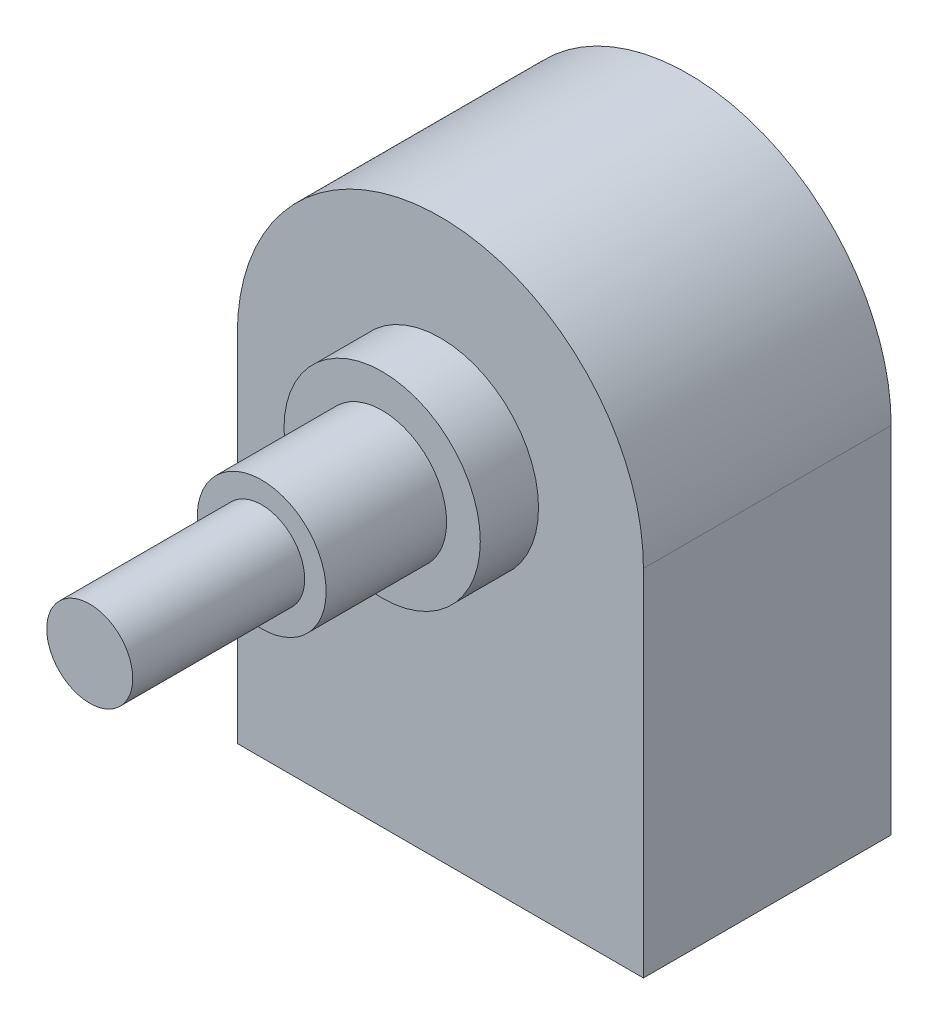
ISO-10303-21;
HEADER;
FILE_DESCRIPTION(('STEP AP214'),'2;1');
FILE_NAME('part.step','',(''),(''),'','','');
FILE_SCHEMA(('AUTOMOTIVE_DESIGN { 1 0 10303 214 1 1 1 1 }'));
ENDSEC;
DATA;
#1=APPLICATION_CONTEXT('core data for automotive mechanical design processes');
#2=APPLICATION_PROTOCOL_DEFINITION('international standard','automotive_design',2000,#1);
#3=PRODUCT_CONTEXT('',#1,'mechanical');
#4=PRODUCT('Part','Part','',(#3));
#5=PRODUCT_RELATED_PRODUCT_CATEGORY('part','',(#4));
#6=PRODUCT_DEFINITION_FORMATION('','',#4);
#7=PRODUCT_DEFINITION_CONTEXT('part definition',#1,'design');
#8=PRODUCT_DEFINITION('design','',#6,#7);
#9=PRODUCT_DEFINITION_SHAPE('','',#8);
#10=(LENGTH_UNIT() NAMED_UNIT(*) SI_UNIT(.MILLI.,.METRE.));
#11=(NAMED_UNIT(*) PLANE_ANGLE_UNIT() SI_UNIT($,.RADIAN.));
#12=(NAMED_UNIT(*) SI_UNIT($,.STERADIAN.) SOLID_ANGLE_UNIT());
#13=UNCERTAINTY_MEASURE_WITH_UNIT(LENGTH_MEASURE(1.E-05),#10,'distance_accuracy_value','');
#14=(GEOMETRIC_REPRESENTATION_CONTEXT(3) GLOBAL_UNCERTAINTY_ASSIGNED_CONTEXT((#13)) GLOBAL_UNIT_ASSIGNED_CONTEXT((#10,
#11,#12)) REPRESENTATION_CONTEXT('',''));
#15=CARTESIAN_POINT('',(0.,0.,0.));
#16=DIRECTION('',(0.,0.,1.));
#17=DIRECTION('',(1.,0.,0.));
#18=AXIS2_PLACEMENT_3D('',#15,#16,#17);
#19=CARTESIAN_POINT('',(-7.18,-7.1,15.3));
#20=DIRECTION('',(0.,-1.,0.));
#21=DIRECTION('',(0.,0.,-1.));
#22=AXIS2_PLACEMENT_3D('',#19,#20,#21);
#23=PLANE('',#22);
#24=DIRECTION('',(1.,0.,0.));
#25=VECTOR('',#24,1.);
#26=CARTESIAN_POINT('',(2.18,-7.1,12.1370865970543));
#27=LINE('',#26,#25);
#28=CARTESIAN_POINT('',(2.18,-7.1,12.1370865970543));
#29=VERTEX_POINT('',#28);
#30=CARTESIAN_POINT('',(2.82,-7.1,12.1370865970543));
#31=VERTEX_POINT('',#30);
#32=EDGE_CURVE('E247',#29,#31,#27,.T.);
#33=ORIENTED_EDGE('',*,*,#32,.F.);
#34=DIRECTION('',(0.,0.,-1.));
#35=VECTOR('',#34,1.);
#36=CARTESIAN_POINT('',(2.18,-7.1,12.1370865970543));
#37=LINE('',#36,#35);
#38=CARTESIAN_POINT('',(2.18,-7.1,12.7770865970543));
#39=VERTEX_POINT('',#38);
#40=EDGE_CURVE('E244',#39,#29,#37,.T.);
#41=ORIENTED_EDGE('',*,*,#40,.F.);
#42=DIRECTION('',(-1.,0.,0.));
#43=VECTOR('',#42,1.);
#44=CARTESIAN_POINT('',(2.18,-7.1,12.7770865970543));
#45=LINE('',#44,#43);
#46=CARTESIAN_POINT('',(2.82,-7.1,12.7770865970543));
#47=VERTEX_POINT('',#46);
#48=EDGE_CURVE('E256',#47,#39,#45,.T.);
#49=ORIENTED_EDGE('',*,*,#48,.F.);
#50=DIRECTION('',(0.,0.,1.));
#51=VECTOR('',#50,1.);
#52=CARTESIAN_POINT('',(2.82,-7.1,12.1370865970543));
#53=LINE('',#52,#51);
#54=EDGE_CURVE('E264',#31,#47,#53,.T.);
#55=ORIENTED_EDGE('',*,*,#54,.F.);
#56=EDGE_LOOP('',(#33,#41,#49,#55));
#57=FACE_BOUND('',#56,.T.);
#58=DIRECTION('',(1.,0.,0.));
#59=VECTOR('',#58,1.);
#60=CARTESIAN_POINT('',(-2.82,-7.1,12.1370865970543));
#61=LINE('',#60,#59);
#62=CARTESIAN_POINT('',(-2.82,-7.1,12.1370865970543));
#63=VERTEX_POINT('',#62);
#64=CARTESIAN_POINT('',(-2.18,-7.1,12.1370865970543));
#65=VERTEX_POINT('',#64);
#66=EDGE_CURVE('E318',#63,#65,#61,.T.);
#67=ORIENTED_EDGE('',*,*,#66,.F.);
#68=DIRECTION('',(0.,0.,-1.));
#69=VECTOR('',#68,1.);
#70=CARTESIAN_POINT('',(-2.82,-7.1,12.1370865970543));
#71=LINE('',#70,#69);
#72=CARTESIAN_POINT('',(-2.82,-7.1,12.7770865970543));
#73=VERTEX_POINT('',#72);
#74=EDGE_CURVE('E304',#73,#63,#71,.T.);
#75=ORIENTED_EDGE('',*,*,#74,.F.);
#76=DIRECTION('',(-1.,0.,0.));
#77=VECTOR('',#76,1.);
#78=CARTESIAN_POINT('',(-2.82,-7.1,12.7770865970543));
#79=LINE('',#78,#77);
#80=CARTESIAN_POINT('',(-2.18,-7.1,12.7770865970543));
#81=VERTEX_POINT('',#80);
#82=EDGE_CURVE('E309',#81,#73,#79,.T.);
#83=ORIENTED_EDGE('',*,*,#82,.F.);
#84=DIRECTION('',(0.,0.,1.));
#85=VECTOR('',#84,1.);
#86=CARTESIAN_POINT('',(-2.18,-7.1,12.1370865970543));
#87=LINE('',#86,#85);
#88=EDGE_CURVE('E320',#65,#81,#87,.T.);
#89=ORIENTED_EDGE('',*,*,#88,.F.);
#90=EDGE_LOOP('',(#67,#75,#83,#89));
#91=FACE_BOUND('',#90,.T.);
#92=DIRECTION('',(0.,0.,-1.));
#93=VECTOR('',#92,1.);
#94=CARTESIAN_POINT('',(-7.18,-7.1,8.2));
#95=LINE('',#94,#93);
#96=CARTESIAN_POINT('',(-7.18,-7.1,15.3));
#97=VERTEX_POINT('',#96);
#98=CARTESIAN_POINT('',(-7.18,-7.1,8.2));
#99=VERTEX_POINT('',#98);
#100=EDGE_CURVE('E363',#97,#99,#95,.T.);
#101=ORIENTED_EDGE('',*,*,#100,.T.);
#102=DIRECTION('',(1.,0.,0.));
#103=VECTOR('',#102,1.);
#104=CARTESIAN_POINT('',(7.18,-7.1,8.2));
#105=LINE('',#104,#103);
#106=CARTESIAN_POINT('',(7.18,-7.1,8.2));
#107=VERTEX_POINT('',#106);
#108=EDGE_CURVE('E366',#99,#107,#105,.T.);
#109=ORIENTED_EDGE('',*,*,#108,.T.);
#110=DIRECTION('',(0.,0.,1.));
#111=VECTOR('',#110,1.);
#112=CARTESIAN_POINT('',(7.18,-7.1,8.2));
#113=LINE('',#112,#111);
#114=CARTESIAN_POINT('',(7.18,-7.1,15.3));
#115=VERTEX_POINT('',#114);
#116=EDGE_CURVE('E370',#107,#115,#113,.T.);
#117=ORIENTED_EDGE('',*,*,#116,.T.);
#118=DIRECTION('',(-1.,0.,0.));
#119=VECTOR('',#118,1.);
#120=CARTESIAN_POINT('',(7.18,-7.1,15.3));
#121=LINE('',#120,#119);
#122=EDGE_CURVE('E373',#115,#97,#121,.T.);
#123=ORIENTED_EDGE('',*,*,#122,.T.);
#124=EDGE_LOOP('',(#101,#109,#117,#123));
#125=FACE_BOUND('',#124,.T.);
#126=DIRECTION('',(1.,0.,0.));
#127=VECTOR('',#126,1.);
#128=CARTESIAN_POINT('',(-5.32,-7.1,12.1370865970543));
#129=LINE('',#128,#127);
#130=CARTESIAN_POINT('',(-5.32,-7.1,12.1370865970543));
#131=VERTEX_POINT('',#130);
#132=CARTESIAN_POINT('',(-4.68,-7.1,12.1370865970543));
#133=VERTEX_POINT('',#132);
#134=EDGE_CURVE('E347',#131,#133,#129,.T.);
#135=ORIENTED_EDGE('',*,*,#134,.F.);
#136=DIRECTION('',(0.,0.,-1.));
#137=VECTOR('',#136,1.);
#138=CARTESIAN_POINT('',(-5.32,-7.1,12.1370865970543));
#139=LINE('',#138,#137);
#140=CARTESIAN_POINT('',(-5.32,-7.1,12.7770865970543));
#141=VERTEX_POINT('',#140);
#142=EDGE_CURVE('E333',#141,#131,#139,.T.);
#143=ORIENTED_EDGE('',*,*,#142,.F.);
#144=DIRECTION('',(-1.,0.,0.));
#145=VECTOR('',#144,1.);
#146=CARTESIAN_POINT('',(-5.32,-7.1,12.7770865970543));
#147=LINE('',#146,#145);
#148=CARTESIAN_POINT('',(-4.68,-7.1,12.7770865970543));
#149=VERTEX_POINT('',#148);
#150=EDGE_CURVE('E338',#149,#141,#147,.T.);
#151=ORIENTED_EDGE('',*,*,#150,.F.);
#152=DIRECTION('',(0.,0.,1.));
#153=VECTOR('',#152,1.);
#154=CARTESIAN_POINT('',(-4.68,-7.1,12.1370865970543));
#155=LINE('',#154,#153);
#156=EDGE_CURVE('E349',#133,#149,#155,.T.);
#157=ORIENTED_EDGE('',*,*,#156,.F.);
#158=EDGE_LOOP('',(#135,#143,#151,#157));
#159=FACE_BOUND('',#158,.T.);
#160=DIRECTION('',(1.,0.,0.));
#161=VECTOR('',#160,1.);
#162=CARTESIAN_POINT('',(-0.320000000000002,-7.1,12.1370865970543));
#163=LINE('',#162,#161);
#164=CARTESIAN_POINT('',(-0.320000000000002,-7.1,12.1370865970543));
#165=VERTEX_POINT('',#164);
#166=CARTESIAN_POINT('',(0.319999999999998,-7.1,12.1370865970543));
#167=VERTEX_POINT('',#166);
#168=EDGE_CURVE('E289',#165,#167,#163,.T.);
#169=ORIENTED_EDGE('',*,*,#168,.F.);
#170=DIRECTION('',(0.,0.,-1.));
#171=VECTOR('',#170,1.);
#172=CARTESIAN_POINT('',(-0.320000000000002,-7.1,12.1370865970543));
#173=LINE('',#172,#171);
#174=CARTESIAN_POINT('',(-0.320000000000002,-7.1,12.7770865970543));
#175=VERTEX_POINT('',#174);
#176=EDGE_CURVE('E275',#175,#165,#173,.T.);
#177=ORIENTED_EDGE('',*,*,#176,.F.);
#178=DIRECTION('',(-1.,0.,0.));
#179=VECTOR('',#178,1.);
#180=CARTESIAN_POINT('',(-0.320000000000002,-7.1,12.7770865970543));
#181=LINE('',#180,#179);
#182=CARTESIAN_POINT('',(0.319999999999998,-7.1,12.7770865970543));
#183=VERTEX_POINT('',#182);
#184=EDGE_CURVE('E280',#183,#175,#181,.T.);
#185=ORIENTED_EDGE('',*,*,#184,.F.);
#186=DIRECTION('',(0.,0.,1.));
#187=VECTOR('',#186,1.);
#188=CARTESIAN_POINT('',(0.319999999999998,-7.1,12.1370865970543));
#189=LINE('',#188,#187);
#190=EDGE_CURVE('E291',#167,#183,#189,.T.);
#191=ORIENTED_EDGE('',*,*,#190,.F.);
#192=EDGE_LOOP('',(#169,#177,#185,#191));
#193=FACE_BOUND('',#192,.T.);
#194=DIRECTION('',(1.,0.,0.));
#195=VECTOR('',#194,1.);
#196=CARTESIAN_POINT('',(4.68,-7.1,12.1370865970543));
#197=LINE('',#196,#195);
#198=CARTESIAN_POINT('',(4.68,-7.1,12.1370865970543));
#199=VERTEX_POINT('',#198);
#200=CARTESIAN_POINT('',(5.32,-7.1,12.1370865970543));
#201=VERTEX_POINT('',#200);
#202=EDGE_CURVE('E887',#199,#201,#197,.T.);
#203=ORIENTED_EDGE('',*,*,#202,.F.);
#204=DIRECTION('',(0.,0.,-1.));
#205=VECTOR('',#204,1.);
#206=CARTESIAN_POINT('',(4.68,-7.1,12.1370865970543));
#207=LINE('',#206,#205);
#208=CARTESIAN_POINT('',(4.68,-7.1,12.7770865970543));
#209=VERTEX_POINT('',#208);
#210=EDGE_CURVE('E242',#209,#199,#207,.T.);
#211=ORIENTED_EDGE('',*,*,#210,.F.);
#212=DIRECTION('',(-1.,0.,0.));
#213=VECTOR('',#212,1.);
#214=CARTESIAN_POINT('',(4.68,-7.1,12.7770865970543));
#215=LINE('',#214,#213);
#216=CARTESIAN_POINT('',(5.32,-7.1,12.7770865970543));
#217=VERTEX_POINT('',#216);
#218=EDGE_CURVE('E238',#217,#209,#215,.T.);
#219=ORIENTED_EDGE('',*,*,#218,.F.);
#220=DIRECTION('',(0.,0.,1.));
#221=VECTOR('',#220,1.);
#222=CARTESIAN_POINT('',(5.32,-7.1,12.1370865970543));
#223=LINE('',#222,#221);
#224=EDGE_CURVE('E884',#201,#217,#223,.T.);
#225=ORIENTED_EDGE('',*,*,#224,.F.);
#226=EDGE_LOOP('',(#203,#211,#219,#225));
#227=FACE_BOUND('',#226,.T.);
#228=ADVANCED_FACE('F33',(#57,#91,#125,#159,#193,#227),#23,.T.);
#229=CARTESIAN_POINT('',(0.,13.1,31.5));
#230=DIRECTION('',(0.,0.,1.));
#231=DIRECTION('',(1.,0.,0.));
#232=AXIS2_PLACEMENT_3D('',#229,#230,#231);
#233=PLANE('',#232);
#234=CARTESIAN_POINT('',(0.,13.1,31.5));
#235=DIRECTION('',(0.,0.,1.));
#236=DIRECTION('',(1.,0.,0.));
#237=AXIS2_PLACEMENT_3D('',#234,#235,#236);
#238=CIRCLE('',#237,4.7625);
#239=CARTESIAN_POINT('',(4.76250000000001,13.1,31.5));
#240=VERTEX_POINT('',#239);
#241=EDGE_CURVE('E401',#240,#240,#238,.T.);
#242=ORIENTED_EDGE('',*,*,#241,.T.);
#243=EDGE_LOOP('',(#242));
#244=FACE_BOUND('',#243,.T.);
#245=CARTESIAN_POINT('',(0.,13.1,31.5));
#246=DIRECTION('',(0.,0.,1.));
#247=DIRECTION('',(1.,0.,0.));
#248=AXIS2_PLACEMENT_3D('',#245,#246,#247);
#249=CIRCLE('',#248,3.175);
#250=CARTESIAN_POINT('',(3.17500000000001,13.1,31.5));
#251=VERTEX_POINT('',#250);
#252=EDGE_CURVE('E388',#251,#251,#249,.T.);
#253=ORIENTED_EDGE('',*,*,#252,.F.);
#254=EDGE_LOOP('',(#253));
#255=FACE_BOUND('',#254,.T.);
#256=ADVANCED_FACE('F479',(#244,#255),#233,.T.);
#257=CARTESIAN_POINT('',(0.,13.1,22.6));
#258=DIRECTION('',(0.,0.,1.));
#259=DIRECTION('',(1.,0.,0.));
#260=AXIS2_PLACEMENT_3D('',#257,#258,#259);
#261=PLANE('',#260);
#262=CARTESIAN_POINT('',(0.,13.1,22.6));
#263=DIRECTION('',(0.,0.,1.));
#264=DIRECTION('',(1.,0.,0.));
#265=AXIS2_PLACEMENT_3D('',#262,#263,#264);
#266=CIRCLE('',#265,7.25);
#267=CARTESIAN_POINT('',(7.25000000000001,13.1,22.6));
#268=VERTEX_POINT('',#267);
#269=EDGE_CURVE('E404',#268,#268,#266,.T.);
#270=ORIENTED_EDGE('',*,*,#269,.T.);
#271=EDGE_LOOP('',(#270));
#272=FACE_BOUND('',#271,.T.);
#273=CARTESIAN_POINT('',(0.,13.1,22.6));
#274=DIRECTION('',(0.,0.,1.));
#275=DIRECTION('',(1.,0.,0.));
#276=AXIS2_PLACEMENT_3D('',#273,#274,#275);
#277=CIRCLE('',#276,4.7625);
#278=CARTESIAN_POINT('',(4.76250000000001,13.1,22.6));
#279=VERTEX_POINT('',#278);
#280=EDGE_CURVE('E398',#279,#279,#277,.T.);
#281=ORIENTED_EDGE('',*,*,#280,.F.);
#282=EDGE_LOOP('',(#281));
#283=FACE_BOUND('',#282,.T.);
#284=ADVANCED_FACE('F459',(#272,#283),#261,.T.);
#285=CARTESIAN_POINT('',(0.,13.1,18.3));
#286=DIRECTION('',(0.,0.,-1.));
#287=DIRECTION('',(-1.,0.,0.));
#288=AXIS2_PLACEMENT_3D('',#285,#286,#287);
#289=PLANE('',#288);
#290=CARTESIAN_POINT('',(0.,13.1,18.3));
#291=DIRECTION('',(0.,0.,1.));
#292=DIRECTION('',(-1.,0.,0.));
#293=AXIS2_PLACEMENT_3D('',#290,#291,#292);
#294=CIRCLE('',#293,15.);
#295=CARTESIAN_POINT('',(15.,13.1,18.3));
#296=VERTEX_POINT('',#295);
#297=CARTESIAN_POINT('',(-15.,13.1,18.3));
#298=VERTEX_POINT('',#297);
#299=EDGE_CURVE('E410',#296,#298,#294,.T.);
#300=ORIENTED_EDGE('',*,*,#299,.T.);
#301=DIRECTION('',(0.,-1.,0.));
#302=VECTOR('',#301,1.);
#303=CARTESIAN_POINT('',(-15.,-13.1,18.3));
#304=LINE('',#303,#302);
#305=CARTESIAN_POINT('',(-15.,-13.1,18.3));
#306=VERTEX_POINT('',#305);
#307=EDGE_CURVE('E413',#298,#306,#304,.T.);
#308=ORIENTED_EDGE('',*,*,#307,.T.);
#309=DIRECTION('',(1.,0.,0.));
#310=VECTOR('',#309,1.);
#311=CARTESIAN_POINT('',(-15.,-13.1,18.3));
#312=LINE('',#311,#310);
#313=CARTESIAN_POINT('',(15.,-13.1,18.3));
#314=VERTEX_POINT('',#313);
#315=EDGE_CURVE('E416',#306,#314,#312,.T.);
#316=ORIENTED_EDGE('',*,*,#315,.T.);
#317=DIRECTION('',(0.,1.,0.));
#318=VECTOR('',#317,1.);
#319=CARTESIAN_POINT('',(15.,-13.1,18.3));
#320=LINE('',#319,#318);
#321=EDGE_CURVE('E418',#314,#296,#320,.T.);
#322=ORIENTED_EDGE('',*,*,#321,.T.);
#323=EDGE_LOOP('',(#300,#308,#316,#322));
#324=FACE_BOUND('',#323,.T.);
#325=CARTESIAN_POINT('',(0.,13.1,18.3));
#326=DIRECTION('',(0.,0.,-1.));
#327=DIRECTION('',(-1.,0.,0.));
#328=AXIS2_PLACEMENT_3D('',#325,#326,#327);
#329=CIRCLE('',#328,7.25);
#330=CARTESIAN_POINT('',(-7.24999999999999,13.1,18.3));
#331=VERTEX_POINT('',#330);
#332=EDGE_CURVE('E11',#331,#331,#329,.F.);
#333=ORIENTED_EDGE('',*,*,#332,.F.);
#334=EDGE_LOOP('',(#333));
#335=FACE_BOUND('',#334,.T.);
#336=ADVANCED_FACE('F456',(#324,#335),#289,.F.);
#337=CARTESIAN_POINT('',(0.,13.1,18.3));
#338=DIRECTION('',(0.,0.,-1.));
#339=DIRECTION('',(-1.,0.,0.));
#340=AXIS2_PLACEMENT_3D('',#337,#338,#339);
#341=CYLINDRICAL_SURFACE('',#340,15.);
#342=CARTESIAN_POINT('',(0.,13.1,0.));
#343=DIRECTION('',(0.,0.,1.));
#344=DIRECTION('',(-1.,0.,0.));
#345=AXIS2_PLACEMENT_3D('',#342,#343,#344);
#346=CIRCLE('',#345,15.);
#347=CARTESIAN_POINT('',(15.,13.1,0.));
#348=VERTEX_POINT('',#347);
#349=CARTESIAN_POINT('',(-15.,13.1,0.));
#350=VERTEX_POINT('',#349);
#351=EDGE_CURVE('E409',#348,#350,#346,.T.);
#352=ORIENTED_EDGE('',*,*,#351,.T.);
#353=DIRECTION('',(0.,0.,-1.));
#354=VECTOR('',#353,1.);
#355=CARTESIAN_POINT('',(-15.,13.1,18.3));
#356=LINE('',#355,#354);
#357=EDGE_CURVE('E41',#298,#350,#356,.T.);
#358=ORIENTED_EDGE('',*,*,#357,.F.);
#359=ORIENTED_EDGE('',*,*,#299,.F.);
#360=DIRECTION('',(0.,0.,-1.));
#361=VECTOR('',#360,1.);
#362=CARTESIAN_POINT('',(15.,13.1,18.3));
#363=LINE('',#362,#361);
#364=EDGE_CURVE('E420',#296,#348,#363,.T.);
#365=ORIENTED_EDGE('',*,*,#364,.T.);
#366=EDGE_LOOP('',(#352,#358,#359,#365));
#367=FACE_BOUND('',#366,.T.);
#368=ADVANCED_FACE('F35',(#367),#341,.T.);
#369=CARTESIAN_POINT('',(-15.,-13.1,18.3));
#370=DIRECTION('',(1.,0.,0.));
#371=DIRECTION('',(0.,0.,-1.));
#372=AXIS2_PLACEMENT_3D('',#369,#370,#371);
#373=PLANE('',#372);
#374=DIRECTION('',(0.,-1.,0.));
#375=VECTOR('',#374,1.);
#376=CARTESIAN_POINT('',(-15.,-13.1,0.));
#377=LINE('',#376,#375);
#378=CARTESIAN_POINT('',(-15.,-13.1,0.));
#379=VERTEX_POINT('',#378);
#380=EDGE_CURVE('E423',#350,#379,#377,.T.);
#381=ORIENTED_EDGE('',*,*,#380,.T.);
#382=DIRECTION('',(0.,0.,-1.));
#383=VECTOR('',#382,1.);
#384=CARTESIAN_POINT('',(-15.,-13.1,18.3));
#385=LINE('',#384,#383);
#386=EDGE_CURVE('E433',#306,#379,#385,.T.);
#387=ORIENTED_EDGE('',*,*,#386,.F.);
#388=ORIENTED_EDGE('',*,*,#307,.F.);
#389=ORIENTED_EDGE('',*,*,#357,.T.);
#390=EDGE_LOOP('',(#381,#387,#388,#389));
#391=FACE_BOUND('',#390,.T.);
#392=ADVANCED_FACE('F438',(#391),#373,.F.);
#393=CARTESIAN_POINT('',(-15.,-13.1,18.3));
#394=DIRECTION('',(0.,1.,0.));
#395=DIRECTION('',(0.,0.,1.));
#396=AXIS2_PLACEMENT_3D('',#393,#394,#395);
#397=PLANE('',#396);
#398=DIRECTION('',(1.,0.,0.));
#399=VECTOR('',#398,1.);
#400=CARTESIAN_POINT('',(7.18,-13.1,8.2));
#401=LINE('',#400,#399);
#402=CARTESIAN_POINT('',(-7.18,-13.1,8.2));
#403=VERTEX_POINT('',#402);
#404=CARTESIAN_POINT('',(7.18,-13.1,8.2));
#405=VERTEX_POINT('',#404);
#406=EDGE_CURVE('E378',#403,#405,#401,.T.);
#407=ORIENTED_EDGE('',*,*,#406,.F.);
#408=DIRECTION('',(0.,0.,-1.));
#409=VECTOR('',#408,1.);
#410=CARTESIAN_POINT('',(-7.18,-13.1,8.2));
#411=LINE('',#410,#409);
#412=CARTESIAN_POINT('',(-7.18,-13.1,15.3));
#413=VERTEX_POINT('',#412);
#414=EDGE_CURVE('E362',#413,#403,#411,.T.);
#415=ORIENTED_EDGE('',*,*,#414,.F.);
#416=DIRECTION('',(-1.,0.,0.));
#417=VECTOR('',#416,1.);
#418=CARTESIAN_POINT('',(7.18,-13.1,15.3));
#419=LINE('',#418,#417);
#420=CARTESIAN_POINT('',(7.18,-13.1,15.3));
#421=VERTEX_POINT('',#420);
#422=EDGE_CURVE('E367',#421,#413,#419,.T.);
#423=ORIENTED_EDGE('',*,*,#422,.F.);
#424=DIRECTION('',(0.,0.,1.));
#425=VECTOR('',#424,1.);
#426=CARTESIAN_POINT('',(7.18,-13.1,8.2));
#427=LINE('',#426,#425);
#428=EDGE_CURVE('E381',#405,#421,#427,.T.);
#429=ORIENTED_EDGE('',*,*,#428,.F.);
#430=EDGE_LOOP('',(#407,#415,#423,#429));
#431=FACE_BOUND('',#430,.T.);
#432=DIRECTION('',(1.,0.,0.));
#433=VECTOR('',#432,1.);
#434=CARTESIAN_POINT('',(-15.,-13.1,0.));
#435=LINE('',#434,#433);
#436=CARTESIAN_POINT('',(15.,-13.1,0.));
#437=VERTEX_POINT('',#436);
#438=EDGE_CURVE('E425',#379,#437,#435,.T.);
#439=ORIENTED_EDGE('',*,*,#438,.T.);
#440=DIRECTION('',(0.,0.,-1.));
#441=VECTOR('',#440,1.);
#442=CARTESIAN_POINT('',(15.,-13.1,18.3));
#443=LINE('',#442,#441);
#444=EDGE_CURVE('E430',#314,#437,#443,.T.);
#445=ORIENTED_EDGE('',*,*,#444,.F.);
#446=ORIENTED_EDGE('',*,*,#315,.F.);
#447=ORIENTED_EDGE('',*,*,#386,.T.);
#448=EDGE_LOOP('',(#439,#445,#446,#447));
#449=FACE_BOUND('',#448,.T.);
#450=ADVANCED_FACE('F450',(#431,#449),#397,.F.);
#451=CARTESIAN_POINT('',(15.,-13.1,18.3));
#452=DIRECTION('',(-1.,0.,0.));
#453=DIRECTION('',(0.,0.,1.));
#454=AXIS2_PLACEMENT_3D('',#451,#452,#453);
#455=PLANE('',#454);
#456=DIRECTION('',(0.,1.,0.));
#457=VECTOR('',#456,1.);
#458=CARTESIAN_POINT('',(15.,-13.1,0.));
#459=LINE('',#458,#457);
#460=EDGE_CURVE('E414',#437,#348,#459,.T.);
#461=ORIENTED_EDGE('',*,*,#460,.T.);
#462=ORIENTED_EDGE('',*,*,#364,.F.);
#463=ORIENTED_EDGE('',*,*,#321,.F.);
#464=ORIENTED_EDGE('',*,*,#444,.T.);
#465=EDGE_LOOP('',(#461,#462,#463,#464));
#466=FACE_BOUND('',#465,.T.);
#467=ADVANCED_FACE('F454',(#466),#455,.F.);
#468=CARTESIAN_POINT('',(0.,13.1,0.));
#469=DIRECTION('',(0.,0.,-1.));
#470=DIRECTION('',(-1.,0.,0.));
#471=AXIS2_PLACEMENT_3D('',#468,#469,#470);
#472=PLANE('',#471);
#473=ORIENTED_EDGE('',*,*,#351,.F.);
#474=ORIENTED_EDGE('',*,*,#460,.F.);
#475=ORIENTED_EDGE('',*,*,#438,.F.);
#476=ORIENTED_EDGE('',*,*,#380,.F.);
#477=EDGE_LOOP('',(#473,#474,#475,#476));
#478=FACE_BOUND('',#477,.T.);
#479=ADVANCED_FACE('F446',(#478),#472,.T.);
#480=CARTESIAN_POINT('',(0.,13.1,22.6));
#481=DIRECTION('',(0.,0.,-1.));
#482=DIRECTION('',(-1.,0.,0.));
#483=AXIS2_PLACEMENT_3D('',#480,#481,#482);
#484=CYLINDRICAL_SURFACE('',#483,7.25);
#485=ORIENTED_EDGE('',*,*,#269,.F.);
#486=EDGE_LOOP('',(#485));
#487=FACE_BOUND('',#486,.T.);
#488=ORIENTED_EDGE('',*,*,#332,.T.);
#489=EDGE_LOOP('',(#488));
#490=FACE_BOUND('',#489,.T.);
#491=ADVANCED_FACE('F463',(#487,#490),#484,.T.);
#492=CARTESIAN_POINT('',(0.,13.1,31.5));
#493=DIRECTION('',(0.,0.,-1.));
#494=DIRECTION('',(-1.,0.,0.));
#495=AXIS2_PLACEMENT_3D('',#492,#493,#494);
#496=CYLINDRICAL_SURFACE('',#495,4.7625);
#497=ORIENTED_EDGE('',*,*,#241,.F.);
#498=EDGE_LOOP('',(#497));
#499=FACE_BOUND('',#498,.T.);
#500=ORIENTED_EDGE('',*,*,#280,.T.);
#501=EDGE_LOOP('',(#500));
#502=FACE_BOUND('',#501,.T.);
#503=ADVANCED_FACE('F465',(#499,#502),#496,.T.);
#504=CARTESIAN_POINT('',(0.,13.1,44.2));
#505=DIRECTION('',(0.,0.,-1.));
#506=DIRECTION('',(-1.,0.,0.));
#507=AXIS2_PLACEMENT_3D('',#504,#505,#506);
#508=CYLINDRICAL_SURFACE('',#507,3.175);
#509=CARTESIAN_POINT('',(0.,13.1,44.2));
#510=DIRECTION('',(0.,0.,1.));
#511=DIRECTION('',(1.,0.,0.));
#512=AXIS2_PLACEMENT_3D('',#509,#510,#511);
#513=CIRCLE('',#512,3.175);
#514=CARTESIAN_POINT('',(3.17500000000001,13.1,44.2));
#515=VERTEX_POINT('',#514);
#516=EDGE_CURVE('E395',#515,#515,#513,.T.);
#517=ORIENTED_EDGE('',*,*,#516,.F.);
#518=EDGE_LOOP('',(#517));
#519=FACE_BOUND('',#518,.T.);
#520=ORIENTED_EDGE('',*,*,#252,.T.);
#521=EDGE_LOOP('',(#520));
#522=FACE_BOUND('',#521,.T.);
#523=ADVANCED_FACE('F472',(#519,#522),#508,.T.);
#524=CARTESIAN_POINT('',(0.,13.1,44.2));
#525=DIRECTION('',(0.,0.,1.));
#526=DIRECTION('',(1.,0.,0.));
#527=AXIS2_PLACEMENT_3D('',#524,#525,#526);
#528=PLANE('',#527);
#529=ORIENTED_EDGE('',*,*,#516,.T.);
#530=EDGE_LOOP('',(#529));
#531=FACE_BOUND('',#530,.T.);
#532=ADVANCED_FACE('F508',(#531),#528,.T.);
#533=CARTESIAN_POINT('',(-7.18,-7.1,8.2));
#534=DIRECTION('',(-1.,0.,0.));
#535=DIRECTION('',(0.,0.,1.));
#536=AXIS2_PLACEMENT_3D('',#533,#534,#535);
#537=PLANE('',#536);
#538=ORIENTED_EDGE('',*,*,#414,.T.);
#539=DIRECTION('',(0.,-1.,0.));
#540=VECTOR('',#539,1.);
#541=CARTESIAN_POINT('',(-7.18,-7.1,8.2));
#542=LINE('',#541,#540);
#543=EDGE_CURVE('E376',#99,#403,#542,.T.);
#544=ORIENTED_EDGE('',*,*,#543,.F.);
#545=ORIENTED_EDGE('',*,*,#100,.F.);
#546=DIRECTION('',(0.,-1.,0.));
#547=VECTOR('',#546,1.);
#548=CARTESIAN_POINT('',(-7.18,-7.1,15.3));
#549=LINE('',#548,#547);
#550=EDGE_CURVE('E386',#97,#413,#549,.T.);
#551=ORIENTED_EDGE('',*,*,#550,.T.);
#552=EDGE_LOOP('',(#538,#544,#545,#551));
#553=FACE_BOUND('',#552,.T.);
#554=ADVANCED_FACE('F497',(#553),#537,.F.);
#555=CARTESIAN_POINT('',(7.18,-7.1,15.3));
#556=DIRECTION('',(0.,0.,1.));
#557=DIRECTION('',(1.,0.,0.));
#558=AXIS2_PLACEMENT_3D('',#555,#556,#557);
#559=PLANE('',#558);
#560=ORIENTED_EDGE('',*,*,#422,.T.);
#561=ORIENTED_EDGE('',*,*,#550,.F.);
#562=ORIENTED_EDGE('',*,*,#122,.F.);
#563=DIRECTION('',(0.,-1.,0.));
#564=VECTOR('',#563,1.);
#565=CARTESIAN_POINT('',(7.18,-7.1,15.3));
#566=LINE('',#565,#564);
#567=EDGE_CURVE('E389',#115,#421,#566,.T.);
#568=ORIENTED_EDGE('',*,*,#567,.T.);
#569=EDGE_LOOP('',(#560,#561,#562,#568));
#570=FACE_BOUND('',#569,.T.);
#571=ADVANCED_FACE('F493',(#570),#559,.F.);
#572=CARTESIAN_POINT('',(7.18,-7.1,8.2));
#573=DIRECTION('',(1.,0.,0.));
#574=DIRECTION('',(0.,0.,-1.));
#575=AXIS2_PLACEMENT_3D('',#572,#573,#574);
#576=PLANE('',#575);
#577=ORIENTED_EDGE('',*,*,#428,.T.);
#578=ORIENTED_EDGE('',*,*,#567,.F.);
#579=ORIENTED_EDGE('',*,*,#116,.F.);
#580=DIRECTION('',(0.,-1.,0.));
#581=VECTOR('',#580,1.);
#582=CARTESIAN_POINT('',(7.18,-7.1,8.2));
#583=LINE('',#582,#581);
#584=EDGE_CURVE('E391',#107,#405,#583,.T.);
#585=ORIENTED_EDGE('',*,*,#584,.T.);
#586=EDGE_LOOP('',(#577,#578,#579,#585));
#587=FACE_BOUND('',#586,.T.);
#588=ADVANCED_FACE('F496',(#587),#576,.F.);
#589=CARTESIAN_POINT('',(7.18,-7.1,8.2));
#590=DIRECTION('',(0.,0.,-1.));
#591=DIRECTION('',(-1.,0.,0.));
#592=AXIS2_PLACEMENT_3D('',#589,#590,#591);
#593=PLANE('',#592);
#594=ORIENTED_EDGE('',*,*,#406,.T.);
#595=ORIENTED_EDGE('',*,*,#584,.F.);
#596=ORIENTED_EDGE('',*,*,#108,.F.);
#597=ORIENTED_EDGE('',*,*,#543,.T.);
#598=EDGE_LOOP('',(#594,#595,#596,#597));
#599=FACE_BOUND('',#598,.T.);
#600=ADVANCED_FACE('F501',(#599),#593,.F.);
#601=CARTESIAN_POINT('',(-5.32,-15.1,12.1370865970543));
#602=DIRECTION('',(1.,0.,0.));
#603=DIRECTION('',(0.,0.,-1.));
#604=AXIS2_PLACEMENT_3D('',#601,#602,#603);
#605=PLANE('',#604);
#606=ORIENTED_EDGE('',*,*,#142,.T.);
#607=DIRECTION('',(0.,1.,0.));
#608=VECTOR('',#607,1.);
#609=CARTESIAN_POINT('',(-5.32,-15.1,12.1370865970543));
#610=LINE('',#609,#608);
#611=CARTESIAN_POINT('',(-5.32,-15.1,12.1370865970543));
#612=VERTEX_POINT('',#611);
#613=EDGE_CURVE('E360',#612,#131,#610,.T.);
#614=ORIENTED_EDGE('',*,*,#613,.F.);
#615=DIRECTION('',(0.,0.,-1.));
#616=VECTOR('',#615,1.);
#617=CARTESIAN_POINT('',(-5.32,-15.1,12.1370865970543));
#618=LINE('',#617,#616);
#619=CARTESIAN_POINT('',(-5.32,-15.1,12.7770865970543));
#620=VERTEX_POINT('',#619);
#621=EDGE_CURVE('E334',#620,#612,#618,.T.);
#622=ORIENTED_EDGE('',*,*,#621,.F.);
#623=DIRECTION('',(0.,1.,0.));
#624=VECTOR('',#623,1.);
#625=CARTESIAN_POINT('',(-5.32,-15.1,12.7770865970543));
#626=LINE('',#625,#624);
#627=EDGE_CURVE('E344',#620,#141,#626,.T.);
#628=ORIENTED_EDGE('',*,*,#627,.T.);
#629=EDGE_LOOP('',(#606,#614,#622,#628));
#630=FACE_BOUND('',#629,.T.);
#631=ADVANCED_FACE('F491',(#630),#605,.F.);
#632=CARTESIAN_POINT('',(-5.32,-15.1,12.1370865970543));
#633=DIRECTION('',(0.,0.,1.));
#634=DIRECTION('',(1.,0.,0.));
#635=AXIS2_PLACEMENT_3D('',#632,#633,#634);
#636=PLANE('',#635);
#637=ORIENTED_EDGE('',*,*,#134,.T.);
#638=DIRECTION('',(0.,1.,0.));
#639=VECTOR('',#638,1.);
#640=CARTESIAN_POINT('',(-4.68,-15.1,12.1370865970543));
#641=LINE('',#640,#639);
#642=CARTESIAN_POINT('',(-4.68,-15.1,12.1370865970543));
#643=VERTEX_POINT('',#642);
#644=EDGE_CURVE('E357',#643,#133,#641,.T.);
#645=ORIENTED_EDGE('',*,*,#644,.F.);
#646=DIRECTION('',(1.,0.,0.));
#647=VECTOR('',#646,1.);
#648=CARTESIAN_POINT('',(-5.32,-15.1,12.1370865970543));
#649=LINE('',#648,#647);
#650=EDGE_CURVE('E337',#612,#643,#649,.T.);
#651=ORIENTED_EDGE('',*,*,#650,.F.);
#652=ORIENTED_EDGE('',*,*,#613,.T.);
#653=EDGE_LOOP('',(#637,#645,#651,#652));
#654=FACE_BOUND('',#653,.T.);
#655=ADVANCED_FACE('F627',(#654),#636,.F.);
#656=CARTESIAN_POINT('',(-4.68,-15.1,12.1370865970543));
#657=DIRECTION('',(-1.,0.,0.));
#658=DIRECTION('',(0.,0.,1.));
#659=AXIS2_PLACEMENT_3D('',#656,#657,#658);
#660=PLANE('',#659);
#661=ORIENTED_EDGE('',*,*,#156,.T.);
#662=DIRECTION('',(0.,1.,0.));
#663=VECTOR('',#662,1.);
#664=CARTESIAN_POINT('',(-4.68,-15.1,12.7770865970543));
#665=LINE('',#664,#663);
#666=CARTESIAN_POINT('',(-4.68,-15.1,12.7770865970543));
#667=VERTEX_POINT('',#666);
#668=EDGE_CURVE('E355',#667,#149,#665,.T.);
#669=ORIENTED_EDGE('',*,*,#668,.F.);
#670=DIRECTION('',(0.,0.,1.));
#671=VECTOR('',#670,1.);
#672=CARTESIAN_POINT('',(-4.68,-15.1,12.1370865970543));
#673=LINE('',#672,#671);
#674=EDGE_CURVE('E340',#643,#667,#673,.T.);
#675=ORIENTED_EDGE('',*,*,#674,.F.);
#676=ORIENTED_EDGE('',*,*,#644,.T.);
#677=EDGE_LOOP('',(#661,#669,#675,#676));
#678=FACE_BOUND('',#677,.T.);
#679=ADVANCED_FACE('F635',(#678),#660,.F.);
#680=CARTESIAN_POINT('',(-5.32,-15.1,12.7770865970543));
#681=DIRECTION('',(0.,0.,-1.));
#682=DIRECTION('',(-1.,0.,0.));
#683=AXIS2_PLACEMENT_3D('',#680,#681,#682);
#684=PLANE('',#683);
#685=ORIENTED_EDGE('',*,*,#150,.T.);
#686=ORIENTED_EDGE('',*,*,#627,.F.);
#687=DIRECTION('',(-1.,0.,0.));
#688=VECTOR('',#687,1.);
#689=CARTESIAN_POINT('',(-5.32,-15.1,12.7770865970543));
#690=LINE('',#689,#688);
#691=EDGE_CURVE('E342',#667,#620,#690,.T.);
#692=ORIENTED_EDGE('',*,*,#691,.F.);
#693=ORIENTED_EDGE('',*,*,#668,.T.);
#694=EDGE_LOOP('',(#685,#686,#692,#693));
#695=FACE_BOUND('',#694,.T.);
#696=ADVANCED_FACE('F643',(#695),#684,.F.);
#697=CARTESIAN_POINT('',(-5.32,-15.1,12.7770865970543));
#698=DIRECTION('',(0.,1.,0.));
#699=DIRECTION('',(0.,0.,1.));
#700=AXIS2_PLACEMENT_3D('',#697,#698,#699);
#701=PLANE('',#700);
#702=ORIENTED_EDGE('',*,*,#621,.T.);
#703=ORIENTED_EDGE('',*,*,#650,.T.);
#704=ORIENTED_EDGE('',*,*,#674,.T.);
#705=ORIENTED_EDGE('',*,*,#691,.T.);
#706=EDGE_LOOP('',(#702,#703,#704,#705));
#707=FACE_BOUND('',#706,.T.);
#708=ADVANCED_FACE('F652',(#707),#701,.F.);
#709=CARTESIAN_POINT('',(-2.82,-15.1,12.1370865970543));
#710=DIRECTION('',(1.,0.,0.));
#711=DIRECTION('',(0.,0.,-1.));
#712=AXIS2_PLACEMENT_3D('',#709,#710,#711);
#713=PLANE('',#712);
#714=ORIENTED_EDGE('',*,*,#74,.T.);
#715=DIRECTION('',(0.,1.,0.));
#716=VECTOR('',#715,1.);
#717=CARTESIAN_POINT('',(-2.82,-15.1,12.1370865970543));
#718=LINE('',#717,#716);
#719=CARTESIAN_POINT('',(-2.82,-15.1,12.1370865970543));
#720=VERTEX_POINT('',#719);
#721=EDGE_CURVE('E331',#720,#63,#718,.T.);
#722=ORIENTED_EDGE('',*,*,#721,.F.);
#723=DIRECTION('',(0.,0.,-1.));
#724=VECTOR('',#723,1.);
#725=CARTESIAN_POINT('',(-2.82,-15.1,12.1370865970543));
#726=LINE('',#725,#724);
#727=CARTESIAN_POINT('',(-2.82,-15.1,12.7770865970543));
#728=VERTEX_POINT('',#727);
#729=EDGE_CURVE('E305',#728,#720,#726,.T.);
#730=ORIENTED_EDGE('',*,*,#729,.F.);
#731=DIRECTION('',(0.,1.,0.));
#732=VECTOR('',#731,1.);
#733=CARTESIAN_POINT('',(-2.82,-15.1,12.7770865970543));
#734=LINE('',#733,#732);
#735=EDGE_CURVE('E315',#728,#73,#734,.T.);
#736=ORIENTED_EDGE('',*,*,#735,.T.);
#737=EDGE_LOOP('',(#714,#722,#730,#736));
#738=FACE_BOUND('',#737,.T.);
#739=ADVANCED_FACE('F661',(#738),#713,.F.);
#740=CARTESIAN_POINT('',(-2.82,-15.1,12.1370865970543));
#741=DIRECTION('',(0.,0.,1.));
#742=DIRECTION('',(1.,0.,0.));
#743=AXIS2_PLACEMENT_3D('',#740,#741,#742);
#744=PLANE('',#743);
#745=ORIENTED_EDGE('',*,*,#66,.T.);
#746=DIRECTION('',(0.,1.,0.));
#747=VECTOR('',#746,1.);
#748=CARTESIAN_POINT('',(-2.18,-15.1,12.1370865970543));
#749=LINE('',#748,#747);
#750=CARTESIAN_POINT('',(-2.18,-15.1,12.1370865970543));
#751=VERTEX_POINT('',#750);
#752=EDGE_CURVE('E328',#751,#65,#749,.T.);
#753=ORIENTED_EDGE('',*,*,#752,.F.);
#754=DIRECTION('',(1.,0.,0.));
#755=VECTOR('',#754,1.);
#756=CARTESIAN_POINT('',(-2.82,-15.1,12.1370865970543));
#757=LINE('',#756,#755);
#758=EDGE_CURVE('E308',#720,#751,#757,.T.);
#759=ORIENTED_EDGE('',*,*,#758,.F.);
#760=ORIENTED_EDGE('',*,*,#721,.T.);
#761=EDGE_LOOP('',(#745,#753,#759,#760));
#762=FACE_BOUND('',#761,.T.);
#763=ADVANCED_FACE('F670',(#762),#744,.F.);
#764=CARTESIAN_POINT('',(-2.18,-15.1,12.1370865970543));
#765=DIRECTION('',(-1.,0.,0.));
#766=DIRECTION('',(0.,0.,1.));
#767=AXIS2_PLACEMENT_3D('',#764,#765,#766);
#768=PLANE('',#767);
#769=ORIENTED_EDGE('',*,*,#88,.T.);
#770=DIRECTION('',(0.,1.,0.));
#771=VECTOR('',#770,1.);
#772=CARTESIAN_POINT('',(-2.18,-15.1,12.7770865970543));
#773=LINE('',#772,#771);
#774=CARTESIAN_POINT('',(-2.18,-15.1,12.7770865970543));
#775=VERTEX_POINT('',#774);
#776=EDGE_CURVE('E326',#775,#81,#773,.T.);
#777=ORIENTED_EDGE('',*,*,#776,.F.);
#778=DIRECTION('',(0.,0.,1.));
#779=VECTOR('',#778,1.);
#780=CARTESIAN_POINT('',(-2.18,-15.1,12.1370865970543));
#781=LINE('',#780,#779);
#782=EDGE_CURVE('E311',#751,#775,#781,.T.);
#783=ORIENTED_EDGE('',*,*,#782,.F.);
#784=ORIENTED_EDGE('',*,*,#752,.T.);
#785=EDGE_LOOP('',(#769,#777,#783,#784));
#786=FACE_BOUND('',#785,.T.);
#787=ADVANCED_FACE('F679',(#786),#768,.F.);
#788=CARTESIAN_POINT('',(-2.82,-15.1,12.7770865970543));
#789=DIRECTION('',(0.,0.,-1.));
#790=DIRECTION('',(-1.,0.,0.));
#791=AXIS2_PLACEMENT_3D('',#788,#789,#790);
#792=PLANE('',#791);
#793=ORIENTED_EDGE('',*,*,#82,.T.);
#794=ORIENTED_EDGE('',*,*,#735,.F.);
#795=DIRECTION('',(-1.,0.,0.));
#796=VECTOR('',#795,1.);
#797=CARTESIAN_POINT('',(-2.82,-15.1,12.7770865970543));
#798=LINE('',#797,#796);
#799=EDGE_CURVE('E313',#775,#728,#798,.T.);
#800=ORIENTED_EDGE('',*,*,#799,.F.);
#801=ORIENTED_EDGE('',*,*,#776,.T.);
#802=EDGE_LOOP('',(#793,#794,#800,#801));
#803=FACE_BOUND('',#802,.T.);
#804=ADVANCED_FACE('F688',(#803),#792,.F.);
#805=CARTESIAN_POINT('',(-2.82,-15.1,12.7770865970543));
#806=DIRECTION('',(0.,1.,0.));
#807=DIRECTION('',(0.,0.,1.));
#808=AXIS2_PLACEMENT_3D('',#805,#806,#807);
#809=PLANE('',#808);
#810=ORIENTED_EDGE('',*,*,#729,.T.);
#811=ORIENTED_EDGE('',*,*,#758,.T.);
#812=ORIENTED_EDGE('',*,*,#782,.T.);
#813=ORIENTED_EDGE('',*,*,#799,.T.);
#814=EDGE_LOOP('',(#810,#811,#812,#813));
#815=FACE_BOUND('',#814,.T.);
#816=ADVANCED_FACE('F697',(#815),#809,.F.);
#817=CARTESIAN_POINT('',(-0.320000000000002,-15.1,12.1370865970543));
#818=DIRECTION('',(1.,0.,0.));
#819=DIRECTION('',(0.,0.,-1.));
#820=AXIS2_PLACEMENT_3D('',#817,#818,#819);
#821=PLANE('',#820);
#822=ORIENTED_EDGE('',*,*,#176,.T.);
#823=DIRECTION('',(0.,1.,0.));
#824=VECTOR('',#823,1.);
#825=CARTESIAN_POINT('',(-0.320000000000002,-15.1,12.1370865970543));
#826=LINE('',#825,#824);
#827=CARTESIAN_POINT('',(-0.320000000000002,-15.1,12.1370865970543));
#828=VERTEX_POINT('',#827);
#829=EDGE_CURVE('E302',#828,#165,#826,.T.);
#830=ORIENTED_EDGE('',*,*,#829,.F.);
#831=DIRECTION('',(0.,0.,-1.));
#832=VECTOR('',#831,1.);
#833=CARTESIAN_POINT('',(-0.320000000000002,-15.1,12.1370865970543));
#834=LINE('',#833,#832);
#835=CARTESIAN_POINT('',(-0.320000000000002,-15.1,12.7770865970543));
#836=VERTEX_POINT('',#835);
#837=EDGE_CURVE('E276',#836,#828,#834,.T.);
#838=ORIENTED_EDGE('',*,*,#837,.F.);
#839=DIRECTION('',(0.,1.,0.));
#840=VECTOR('',#839,1.);
#841=CARTESIAN_POINT('',(-0.320000000000002,-15.1,12.7770865970543));
#842=LINE('',#841,#840);
#843=EDGE_CURVE('E286',#836,#175,#842,.T.);
#844=ORIENTED_EDGE('',*,*,#843,.T.);
#845=EDGE_LOOP('',(#822,#830,#838,#844));
#846=FACE_BOUND('',#845,.T.);
#847=ADVANCED_FACE('F706',(#846),#821,.F.);
#848=CARTESIAN_POINT('',(-0.320000000000002,-15.1,12.1370865970543));
#849=DIRECTION('',(0.,0.,1.));
#850=DIRECTION('',(1.,0.,0.));
#851=AXIS2_PLACEMENT_3D('',#848,#849,#850);
#852=PLANE('',#851);
#853=ORIENTED_EDGE('',*,*,#168,.T.);
#854=DIRECTION('',(0.,1.,0.));
#855=VECTOR('',#854,1.);
#856=CARTESIAN_POINT('',(0.319999999999998,-15.1,12.1370865970543));
#857=LINE('',#856,#855);
#858=CARTESIAN_POINT('',(0.319999999999998,-15.1,12.1370865970543));
#859=VERTEX_POINT('',#858);
#860=EDGE_CURVE('E299',#859,#167,#857,.T.);
#861=ORIENTED_EDGE('',*,*,#860,.F.);
#862=DIRECTION('',(1.,0.,0.));
#863=VECTOR('',#862,1.);
#864=CARTESIAN_POINT('',(-0.320000000000002,-15.1,12.1370865970543));
#865=LINE('',#864,#863);
#866=EDGE_CURVE('E279',#828,#859,#865,.T.);
#867=ORIENTED_EDGE('',*,*,#866,.F.);
#868=ORIENTED_EDGE('',*,*,#829,.T.);
#869=EDGE_LOOP('',(#853,#861,#867,#868));
#870=FACE_BOUND('',#869,.T.);
#871=ADVANCED_FACE('F715',(#870),#852,.F.);
#872=CARTESIAN_POINT('',(0.319999999999998,-15.1,12.1370865970543));
#873=DIRECTION('',(-1.,0.,0.));
#874=DIRECTION('',(0.,0.,1.));
#875=AXIS2_PLACEMENT_3D('',#872,#873,#874);
#876=PLANE('',#875);
#877=ORIENTED_EDGE('',*,*,#190,.T.);
#878=DIRECTION('',(0.,1.,0.));
#879=VECTOR('',#878,1.);
#880=CARTESIAN_POINT('',(0.319999999999998,-15.1,12.7770865970543));
#881=LINE('',#880,#879);
#882=CARTESIAN_POINT('',(0.319999999999998,-15.1,12.7770865970543));
#883=VERTEX_POINT('',#882);
#884=EDGE_CURVE('E297',#883,#183,#881,.T.);
#885=ORIENTED_EDGE('',*,*,#884,.F.);
#886=DIRECTION('',(0.,0.,1.));
#887=VECTOR('',#886,1.);
#888=CARTESIAN_POINT('',(0.319999999999998,-15.1,12.1370865970543));
#889=LINE('',#888,#887);
#890=EDGE_CURVE('E282',#859,#883,#889,.T.);
#891=ORIENTED_EDGE('',*,*,#890,.F.);
#892=ORIENTED_EDGE('',*,*,#860,.T.);
#893=EDGE_LOOP('',(#877,#885,#891,#892));
#894=FACE_BOUND('',#893,.T.);
#895=ADVANCED_FACE('F724',(#894),#876,.F.);
#896=CARTESIAN_POINT('',(-0.320000000000002,-15.1,12.7770865970543));
#897=DIRECTION('',(0.,0.,-1.));
#898=DIRECTION('',(-1.,0.,0.));
#899=AXIS2_PLACEMENT_3D('',#896,#897,#898);
#900=PLANE('',#899);
#901=ORIENTED_EDGE('',*,*,#184,.T.);
#902=ORIENTED_EDGE('',*,*,#843,.F.);
#903=DIRECTION('',(-1.,0.,0.));
#904=VECTOR('',#903,1.);
#905=CARTESIAN_POINT('',(-0.320000000000002,-15.1,12.7770865970543));
#906=LINE('',#905,#904);
#907=EDGE_CURVE('E284',#883,#836,#906,.T.);
#908=ORIENTED_EDGE('',*,*,#907,.F.);
#909=ORIENTED_EDGE('',*,*,#884,.T.);
#910=EDGE_LOOP('',(#901,#902,#908,#909));
#911=FACE_BOUND('',#910,.T.);
#912=ADVANCED_FACE('F733',(#911),#900,.F.);
#913=CARTESIAN_POINT('',(-0.320000000000002,-15.1,12.7770865970543));
#914=DIRECTION('',(0.,1.,0.));
#915=DIRECTION('',(0.,0.,1.));
#916=AXIS2_PLACEMENT_3D('',#913,#914,#915);
#917=PLANE('',#916);
#918=ORIENTED_EDGE('',*,*,#837,.T.);
#919=ORIENTED_EDGE('',*,*,#866,.T.);
#920=ORIENTED_EDGE('',*,*,#890,.T.);
#921=ORIENTED_EDGE('',*,*,#907,.T.);
#922=EDGE_LOOP('',(#918,#919,#920,#921));
#923=FACE_BOUND('',#922,.T.);
#924=ADVANCED_FACE('F742',(#923),#917,.F.);
#925=CARTESIAN_POINT('',(2.18,-15.1,12.1370865970543));
#926=DIRECTION('',(1.,0.,0.));
#927=DIRECTION('',(0.,0.,-1.));
#928=AXIS2_PLACEMENT_3D('',#925,#926,#927);
#929=PLANE('',#928);
#930=ORIENTED_EDGE('',*,*,#40,.T.);
#931=DIRECTION('',(0.,1.,0.));
#932=VECTOR('',#931,1.);
#933=CARTESIAN_POINT('',(2.18,-15.1,12.1370865970543));
#934=LINE('',#933,#932);
#935=CARTESIAN_POINT('',(2.18,-15.1,12.1370865970543));
#936=VERTEX_POINT('',#935);
#937=EDGE_CURVE('E273',#936,#29,#934,.T.);
#938=ORIENTED_EDGE('',*,*,#937,.F.);
#939=DIRECTION('',(0.,0.,-1.));
#940=VECTOR('',#939,1.);
#941=CARTESIAN_POINT('',(2.18,-15.1,12.1370865970543));
#942=LINE('',#941,#940);
#943=CARTESIAN_POINT('',(2.18,-15.1,12.7770865970543));
#944=VERTEX_POINT('',#943);
#945=EDGE_CURVE('E252',#944,#936,#942,.T.);
#946=ORIENTED_EDGE('',*,*,#945,.F.);
#947=DIRECTION('',(0.,1.,0.));
#948=VECTOR('',#947,1.);
#949=CARTESIAN_POINT('',(2.18,-15.1,12.7770865970543));
#950=LINE('',#949,#948);
#951=EDGE_CURVE('E261',#944,#39,#950,.T.);
#952=ORIENTED_EDGE('',*,*,#951,.T.);
#953=EDGE_LOOP('',(#930,#938,#946,#952));
#954=FACE_BOUND('',#953,.T.);
#955=ADVANCED_FACE('F751',(#954),#929,.F.);
#956=CARTESIAN_POINT('',(2.18,-15.1,12.1370865970543));
#957=DIRECTION('',(0.,0.,1.));
#958=DIRECTION('',(1.,0.,0.));
#959=AXIS2_PLACEMENT_3D('',#956,#957,#958);
#960=PLANE('',#959);
#961=ORIENTED_EDGE('',*,*,#32,.T.);
#962=DIRECTION('',(0.,1.,0.));
#963=VECTOR('',#962,1.);
#964=CARTESIAN_POINT('',(2.82,-15.1,12.1370865970543));
#965=LINE('',#964,#963);
#966=CARTESIAN_POINT('',(2.82,-15.1,12.1370865970543));
#967=VERTEX_POINT('',#966);
#968=EDGE_CURVE('E270',#967,#31,#965,.T.);
#969=ORIENTED_EDGE('',*,*,#968,.F.);
#970=DIRECTION('',(1.,0.,0.));
#971=VECTOR('',#970,1.);
#972=CARTESIAN_POINT('',(2.18,-15.1,12.1370865970543));
#973=LINE('',#972,#971);
#974=EDGE_CURVE('E255',#936,#967,#973,.T.);
#975=ORIENTED_EDGE('',*,*,#974,.F.);
#976=ORIENTED_EDGE('',*,*,#937,.T.);
#977=EDGE_LOOP('',(#961,#969,#975,#976));
#978=FACE_BOUND('',#977,.T.);
#979=ADVANCED_FACE('F760',(#978),#960,.F.);
#980=CARTESIAN_POINT('',(2.82,-15.1,12.1370865970543));
#981=DIRECTION('',(-1.,0.,0.));
#982=DIRECTION('',(0.,0.,1.));
#983=AXIS2_PLACEMENT_3D('',#980,#981,#982);
#984=PLANE('',#983);
#985=ORIENTED_EDGE('',*,*,#54,.T.);
#986=DIRECTION('',(0.,1.,0.));
#987=VECTOR('',#986,1.);
#988=CARTESIAN_POINT('',(2.82,-15.1,12.7770865970543));
#989=LINE('',#988,#987);
#990=CARTESIAN_POINT('',(2.82,-15.1,12.7770865970543));
#991=VERTEX_POINT('',#990);
#992=EDGE_CURVE('E56',#991,#47,#989,.T.);
#993=ORIENTED_EDGE('',*,*,#992,.F.);
#994=DIRECTION('',(0.,0.,1.));
#995=VECTOR('',#994,1.);
#996=CARTESIAN_POINT('',(2.82,-15.1,12.1370865970543));
#997=LINE('',#996,#995);
#998=EDGE_CURVE('E258',#967,#991,#997,.T.);
#999=ORIENTED_EDGE('',*,*,#998,.F.);
#1000=ORIENTED_EDGE('',*,*,#968,.T.);
#1001=EDGE_LOOP('',(#985,#993,#999,#1000));
#1002=FACE_BOUND('',#1001,.T.);
#1003=ADVANCED_FACE('F769',(#1002),#984,.F.);
#1004=CARTESIAN_POINT('',(2.18,-15.1,12.7770865970543));
#1005=DIRECTION('',(0.,0.,-1.));
#1006=DIRECTION('',(-1.,0.,0.));
#1007=AXIS2_PLACEMENT_3D('',#1004,#1005,#1006);
#1008=PLANE('',#1007);
#1009=ORIENTED_EDGE('',*,*,#48,.T.);
#1010=ORIENTED_EDGE('',*,*,#951,.F.);
#1011=DIRECTION('',(-1.,0.,0.));
#1012=VECTOR('',#1011,1.);
#1013=CARTESIAN_POINT('',(2.18,-15.1,12.7770865970543));
#1014=LINE('',#1013,#1012);
#1015=EDGE_CURVE('E260',#991,#944,#1014,.T.);
#1016=ORIENTED_EDGE('',*,*,#1015,.F.);
#1017=ORIENTED_EDGE('',*,*,#992,.T.);
#1018=EDGE_LOOP('',(#1009,#1010,#1016,#1017));
#1019=FACE_BOUND('',#1018,.T.);
#1020=ADVANCED_FACE('F778',(#1019),#1008,.F.);
#1021=CARTESIAN_POINT('',(2.18,-15.1,12.7770865970543));
#1022=DIRECTION('',(0.,1.,0.));
#1023=DIRECTION('',(0.,0.,1.));
#1024=AXIS2_PLACEMENT_3D('',#1021,#1022,#1023);
#1025=PLANE('',#1024);
#1026=ORIENTED_EDGE('',*,*,#945,.T.);
#1027=ORIENTED_EDGE('',*,*,#974,.T.);
#1028=ORIENTED_EDGE('',*,*,#998,.T.);
#1029=ORIENTED_EDGE('',*,*,#1015,.T.);
#1030=EDGE_LOOP('',(#1026,#1027,#1028,#1029));
#1031=FACE_BOUND('',#1030,.T.);
#1032=ADVANCED_FACE('F787',(#1031),#1025,.F.);
#1033=CARTESIAN_POINT('',(4.68,-15.1,12.1370865970543));
#1034=DIRECTION('',(1.,0.,0.));
#1035=DIRECTION('',(0.,0.,-1.));
#1036=AXIS2_PLACEMENT_3D('',#1033,#1034,#1035);
#1037=PLANE('',#1036);
#1038=ORIENTED_EDGE('',*,*,#210,.T.);
#1039=DIRECTION('',(0.,1.,0.));
#1040=VECTOR('',#1039,1.);
#1041=CARTESIAN_POINT('',(4.68,-15.1,12.1370865970543));
#1042=LINE('',#1041,#1040);
#1043=CARTESIAN_POINT('',(4.68,-15.1,12.1370865970543));
#1044=VERTEX_POINT('',#1043);
#1045=EDGE_CURVE('E223',#1044,#199,#1042,.T.);
#1046=ORIENTED_EDGE('',*,*,#1045,.F.);
#1047=DIRECTION('',(0.,0.,-1.));
#1048=VECTOR('',#1047,1.);
#1049=CARTESIAN_POINT('',(4.68,-15.1,12.1370865970543));
#1050=LINE('',#1049,#1048);
#1051=CARTESIAN_POINT('',(4.68,-15.1,12.7770865970543));
#1052=VERTEX_POINT('',#1051);
#1053=EDGE_CURVE('E230',#1052,#1044,#1050,.T.);
#1054=ORIENTED_EDGE('',*,*,#1053,.F.);
#1055=DIRECTION('',(0.,1.,0.));
#1056=VECTOR('',#1055,1.);
#1057=CARTESIAN_POINT('',(4.68,-15.1,12.7770865970543));
#1058=LINE('',#1057,#1056);
#1059=EDGE_CURVE('E881',#1052,#209,#1058,.T.);
#1060=ORIENTED_EDGE('',*,*,#1059,.T.);
#1061=EDGE_LOOP('',(#1038,#1046,#1054,#1060));
#1062=FACE_BOUND('',#1061,.T.);
#1063=ADVANCED_FACE('F240',(#1062),#1037,.F.);
#1064=CARTESIAN_POINT('',(4.68,-15.1,12.1370865970543));
#1065=DIRECTION('',(0.,0.,1.));
#1066=DIRECTION('',(1.,0.,0.));
#1067=AXIS2_PLACEMENT_3D('',#1064,#1065,#1066);
#1068=PLANE('',#1067);
#1069=ORIENTED_EDGE('',*,*,#202,.T.);
#1070=DIRECTION('',(0.,1.,0.));
#1071=VECTOR('',#1070,1.);
#1072=CARTESIAN_POINT('',(5.32,-15.1,12.1370865970543));
#1073=LINE('',#1072,#1071);
#1074=CARTESIAN_POINT('',(5.32,-15.1,12.1370865970543));
#1075=VERTEX_POINT('',#1074);
#1076=EDGE_CURVE('E226',#1075,#201,#1073,.T.);
#1077=ORIENTED_EDGE('',*,*,#1076,.F.);
#1078=DIRECTION('',(1.,0.,0.));
#1079=VECTOR('',#1078,1.);
#1080=CARTESIAN_POINT('',(4.68,-15.1,12.1370865970543));
#1081=LINE('',#1080,#1079);
#1082=EDGE_CURVE('E219',#1044,#1075,#1081,.T.);
#1083=ORIENTED_EDGE('',*,*,#1082,.F.);
#1084=ORIENTED_EDGE('',*,*,#1045,.T.);
#1085=EDGE_LOOP('',(#1069,#1077,#1083,#1084));
#1086=FACE_BOUND('',#1085,.T.);
#1087=ADVANCED_FACE('F221',(#1086),#1068,.F.);
#1088=CARTESIAN_POINT('',(5.32,-15.1,12.1370865970543));
#1089=DIRECTION('',(-1.,0.,0.));
#1090=DIRECTION('',(0.,0.,1.));
#1091=AXIS2_PLACEMENT_3D('',#1088,#1089,#1090);
#1092=PLANE('',#1091);
#1093=ORIENTED_EDGE('',*,*,#224,.T.);
#1094=DIRECTION('',(0.,1.,0.));
#1095=VECTOR('',#1094,1.);
#1096=CARTESIAN_POINT('',(5.32,-15.1,12.7770865970543));
#1097=LINE('',#1096,#1095);
#1098=CARTESIAN_POINT('',(5.32,-15.1,12.7770865970543));
#1099=VERTEX_POINT('',#1098);
#1100=EDGE_CURVE('E48',#1099,#217,#1097,.T.);
#1101=ORIENTED_EDGE('',*,*,#1100,.F.);
#1102=DIRECTION('',(0.,0.,1.));
#1103=VECTOR('',#1102,1.);
#1104=CARTESIAN_POINT('',(5.32,-15.1,12.1370865970543));
#1105=LINE('',#1104,#1103);
#1106=EDGE_CURVE('E229',#1075,#1099,#1105,.T.);
#1107=ORIENTED_EDGE('',*,*,#1106,.F.);
#1108=ORIENTED_EDGE('',*,*,#1076,.T.);
#1109=EDGE_LOOP('',(#1093,#1101,#1107,#1108));
#1110=FACE_BOUND('',#1109,.T.);
#1111=ADVANCED_FACE('F810',(#1110),#1092,.F.);
#1112=CARTESIAN_POINT('',(4.68,-15.1,12.7770865970543));
#1113=DIRECTION('',(0.,0.,-1.));
#1114=DIRECTION('',(-1.,0.,0.));
#1115=AXIS2_PLACEMENT_3D('',#1112,#1113,#1114);
#1116=PLANE('',#1115);
#1117=ORIENTED_EDGE('',*,*,#218,.T.);
#1118=ORIENTED_EDGE('',*,*,#1059,.F.);
#1119=DIRECTION('',(-1.,0.,0.));
#1120=VECTOR('',#1119,1.);
#1121=CARTESIAN_POINT('',(4.68,-15.1,12.7770865970543));
#1122=LINE('',#1121,#1120);
#1123=EDGE_CURVE('E234',#1099,#1052,#1122,.T.);
#1124=ORIENTED_EDGE('',*,*,#1123,.F.);
#1125=ORIENTED_EDGE('',*,*,#1100,.T.);
#1126=EDGE_LOOP('',(#1117,#1118,#1124,#1125));
#1127=FACE_BOUND('',#1126,.T.);
#1128=ADVANCED_FACE('F818',(#1127),#1116,.F.);
#1129=CARTESIAN_POINT('',(4.68,-15.1,12.7770865970543));
#1130=DIRECTION('',(0.,1.,0.));
#1131=DIRECTION('',(0.,0.,1.));
#1132=AXIS2_PLACEMENT_3D('',#1129,#1130,#1131);
#1133=PLANE('',#1132);
#1134=ORIENTED_EDGE('',*,*,#1053,.T.);
#1135=ORIENTED_EDGE('',*,*,#1082,.T.);
#1136=ORIENTED_EDGE('',*,*,#1106,.T.);
#1137=ORIENTED_EDGE('',*,*,#1123,.T.);
#1138=EDGE_LOOP('',(#1134,#1135,#1136,#1137));
#1139=FACE_BOUND('',#1138,.T.);
#1140=ADVANCED_FACE('F233',(#1139),#1133,.F.);
#1141=CLOSED_SHELL('',(#228,#256,#284,#336,#368,#392,#450,#467,#479,#491,#503,#523,#532,#554,
#571,#588,#600,#631,#655,#679,#696,#708,#739,#763,#787,#804,#816,#847,#871,#895,#912,#924,#955,
#979,#1003,#1020,#1032,#1063,#1087,#1111,#1128,#1140));
#1142=MANIFOLD_SOLID_BREP('B2',#1141);
#1143=ADVANCED_BREP_SHAPE_REPRESENTATION('',(#18,#1142),#14);
#1144=SHAPE_DEFINITION_REPRESENTATION(#9,#1143);
ENDSEC;
END-ISO-10303-21;
